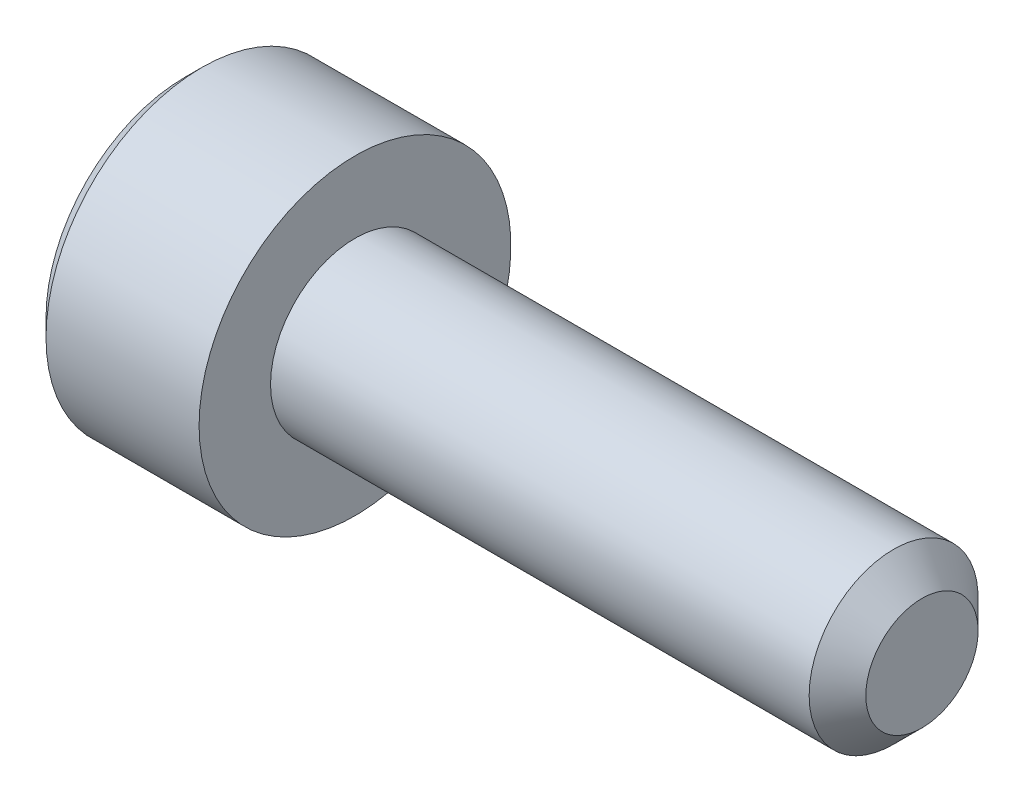
ISO-10303-21;
HEADER;
FILE_DESCRIPTION(('STEP AP214'),'2;1');
FILE_NAME('part.step','',(''),(''),'','','');
FILE_SCHEMA(('AUTOMOTIVE_DESIGN { 1 0 10303 214 1 1 1 1 }'));
ENDSEC;
DATA;
#1=APPLICATION_CONTEXT('core data for automotive mechanical design processes');
#2=APPLICATION_PROTOCOL_DEFINITION('international standard','automotive_design',2000,#1);
#3=PRODUCT_CONTEXT('',#1,'mechanical');
#4=PRODUCT('Part','Part','',(#3));
#5=PRODUCT_RELATED_PRODUCT_CATEGORY('part','',(#4));
#6=PRODUCT_DEFINITION_FORMATION('','',#4);
#7=PRODUCT_DEFINITION_CONTEXT('part definition',#1,'design');
#8=PRODUCT_DEFINITION('design','',#6,#7);
#9=PRODUCT_DEFINITION_SHAPE('','',#8);
#10=(LENGTH_UNIT() NAMED_UNIT(*) SI_UNIT(.MILLI.,.METRE.));
#11=(NAMED_UNIT(*) PLANE_ANGLE_UNIT() SI_UNIT($,.RADIAN.));
#12=(NAMED_UNIT(*) SI_UNIT($,.STERADIAN.) SOLID_ANGLE_UNIT());
#13=UNCERTAINTY_MEASURE_WITH_UNIT(LENGTH_MEASURE(1.E-05),#10,'distance_accuracy_value','');
#14=(GEOMETRIC_REPRESENTATION_CONTEXT(3) GLOBAL_UNCERTAINTY_ASSIGNED_CONTEXT((#13)) GLOBAL_UNIT_ASSIGNED_CONTEXT((#10,
#11,#12)) REPRESENTATION_CONTEXT('',''));
#15=CARTESIAN_POINT('',(0.,0.,0.));
#16=DIRECTION('',(0.,0.,1.));
#17=DIRECTION('',(1.,0.,0.));
#18=AXIS2_PLACEMENT_3D('',#15,#16,#17);
#19=CARTESIAN_POINT('',(0.,0.,0.));
#20=DIRECTION('',(1.,0.,0.));
#21=DIRECTION('',(0.,0.,-1.));
#22=AXIS2_PLACEMENT_3D('',#19,#20,#21);
#23=PLANE('',#22);
#24=DIRECTION('',(0.,0.866025403784439,0.5));
#25=VECTOR('',#24,1.);
#26=CARTESIAN_POINT('',(0.,1.4,-0.981495457622362));
#27=LINE('',#26,#25);
#28=CARTESIAN_POINT('',(0.,0.,-1.78978583448784));
#29=VERTEX_POINT('',#28);
#30=CARTESIAN_POINT('',(0.,1.55,-0.894892917243918));
#31=VERTEX_POINT('',#30);
#32=EDGE_CURVE('E154',#29,#31,#27,.T.);
#33=ORIENTED_EDGE('',*,*,#32,.T.);
#34=DIRECTION('',(0.,0.,1.));
#35=VECTOR('',#34,1.);
#36=CARTESIAN_POINT('',(0.,1.55,0.721687836487032));
#37=LINE('',#36,#35);
#38=CARTESIAN_POINT('',(0.,1.55,0.894892917243919));
#39=VERTEX_POINT('',#38);
#40=EDGE_CURVE('E164',#31,#39,#37,.T.);
#41=ORIENTED_EDGE('',*,*,#40,.T.);
#42=DIRECTION('',(0.,-0.866025403784439,0.5));
#43=VECTOR('',#42,1.);
#44=CARTESIAN_POINT('',(0.,0.15,1.7031832941094));
#45=LINE('',#44,#43);
#46=CARTESIAN_POINT('',(0.,0.,1.78978583448784));
#47=VERTEX_POINT('',#46);
#48=EDGE_CURVE('E162',#39,#47,#45,.T.);
#49=ORIENTED_EDGE('',*,*,#48,.T.);
#50=DIRECTION('',(0.,-0.866025403784439,-0.5));
#51=VECTOR('',#50,1.);
#52=CARTESIAN_POINT('',(0.,-1.4,0.981495457622364));
#53=LINE('',#52,#51);
#54=CARTESIAN_POINT('',(0.,-1.55,0.89489291724392));
#55=VERTEX_POINT('',#54);
#56=EDGE_CURVE('E160',#47,#55,#53,.T.);
#57=ORIENTED_EDGE('',*,*,#56,.T.);
#58=DIRECTION('',(0.,0.,-1.));
#59=VECTOR('',#58,1.);
#60=CARTESIAN_POINT('',(0.,-1.55,-0.721687836487031));
#61=LINE('',#60,#59);
#62=CARTESIAN_POINT('',(0.,-1.55,-0.894892917243919));
#63=VERTEX_POINT('',#62);
#64=EDGE_CURVE('E158',#55,#63,#61,.T.);
#65=ORIENTED_EDGE('',*,*,#64,.T.);
#66=DIRECTION('',(0.,0.866025403784439,-0.5));
#67=VECTOR('',#66,1.);
#68=CARTESIAN_POINT('',(0.,-0.149999999999999,-1.7031832941094));
#69=LINE('',#68,#67);
#70=EDGE_CURVE('E156',#63,#29,#69,.T.);
#71=ORIENTED_EDGE('',*,*,#70,.T.);
#72=EDGE_LOOP('',(#33,#41,#49,#57,#65,#71));
#73=FACE_BOUND('',#72,.T.);
#74=CARTESIAN_POINT('',(0.,0.,0.));
#75=DIRECTION('',(1.,0.,0.));
#76=DIRECTION('',(0.,0.,-1.));
#77=AXIS2_PLACEMENT_3D('',#74,#75,#76);
#78=CIRCLE('',#77,2.45);
#79=CARTESIAN_POINT('',(0.,0.,-2.45));
#80=VERTEX_POINT('',#79);
#81=EDGE_CURVE('E148',#80,#80,#78,.F.);
#82=ORIENTED_EDGE('',*,*,#81,.T.);
#83=EDGE_LOOP('',(#82));
#84=FACE_BOUND('',#83,.T.);
#85=ADVANCED_FACE('F33',(#73,#84),#23,.F.);
#86=CARTESIAN_POINT('',(13.,0.,0.));
#87=DIRECTION('',(-1.,0.,0.));
#88=DIRECTION('',(0.,0.,1.));
#89=AXIS2_PLACEMENT_3D('',#86,#87,#88);
#90=PLANE('',#89);
#91=CARTESIAN_POINT('',(13.,0.,0.));
#92=DIRECTION('',(-1.,0.,0.));
#93=DIRECTION('',(0.,0.,1.));
#94=AXIS2_PLACEMENT_3D('',#91,#92,#93);
#95=CIRCLE('',#94,0.989999999999991);
#96=CARTESIAN_POINT('',(13.,0.,0.989999999999991));
#97=VERTEX_POINT('',#96);
#98=EDGE_CURVE('E145',#97,#97,#95,.F.);
#99=ORIENTED_EDGE('',*,*,#98,.T.);
#100=EDGE_LOOP('',(#99));
#101=FACE_BOUND('',#100,.T.);
#102=ADVANCED_FACE('F244',(#101),#90,.F.);
#103=CARTESIAN_POINT('',(-88.7054908485857,0.,0.));
#104=DIRECTION('',(-1.,0.,0.));
#105=DIRECTION('',(0.,0.,1.));
#106=AXIS2_PLACEMENT_3D('',#103,#104,#105);
#107=CYLINDRICAL_SURFACE('',#106,1.49);
#108=CARTESIAN_POINT('',(12.5,0.,0.));
#109=DIRECTION('',(-1.,0.,0.));
#110=DIRECTION('',(0.,0.,1.));
#111=AXIS2_PLACEMENT_3D('',#108,#109,#110);
#112=CIRCLE('',#111,1.49);
#113=CARTESIAN_POINT('',(12.5,0.,1.49));
#114=VERTEX_POINT('',#113);
#115=EDGE_CURVE('E142',#114,#114,#112,.T.);
#116=ORIENTED_EDGE('',*,*,#115,.T.);
#117=EDGE_LOOP('',(#116));
#118=FACE_BOUND('',#117,.T.);
#119=CARTESIAN_POINT('',(3.,0.,0.));
#120=DIRECTION('',(-1.,0.,0.));
#121=DIRECTION('',(0.,0.,1.));
#122=AXIS2_PLACEMENT_3D('',#119,#120,#121);
#123=CIRCLE('',#122,1.49);
#124=CARTESIAN_POINT('',(3.,0.,1.49));
#125=VERTEX_POINT('',#124);
#126=EDGE_CURVE('E134',#125,#125,#123,.T.);
#127=ORIENTED_EDGE('',*,*,#126,.F.);
#128=EDGE_LOOP('',(#127));
#129=FACE_BOUND('',#128,.T.);
#130=ADVANCED_FACE('F249',(#118,#129),#107,.T.);
#131=CARTESIAN_POINT('',(3.,1.49,0.));
#132=DIRECTION('',(-1.,0.,0.));
#133=DIRECTION('',(0.,0.,1.));
#134=AXIS2_PLACEMENT_3D('',#131,#132,#133);
#135=PLANE('',#134);
#136=CARTESIAN_POINT('',(3.,0.,0.));
#137=DIRECTION('',(-1.,0.,0.));
#138=DIRECTION('',(0.,0.,1.));
#139=AXIS2_PLACEMENT_3D('',#136,#137,#138);
#140=CIRCLE('',#139,2.75);
#141=CARTESIAN_POINT('',(3.,0.,2.75));
#142=VERTEX_POINT('',#141);
#143=EDGE_CURVE('E130',#142,#142,#140,.T.);
#144=ORIENTED_EDGE('',*,*,#143,.F.);
#145=EDGE_LOOP('',(#144));
#146=FACE_BOUND('',#145,.T.);
#147=ORIENTED_EDGE('',*,*,#126,.T.);
#148=EDGE_LOOP('',(#147));
#149=FACE_BOUND('',#148,.T.);
#150=ADVANCED_FACE('F259',(#146,#149),#135,.F.);
#151=CARTESIAN_POINT('',(-88.7054908485857,0.,0.));
#152=DIRECTION('',(-1.,0.,0.));
#153=DIRECTION('',(0.,0.,1.));
#154=AXIS2_PLACEMENT_3D('',#151,#152,#153);
#155=CYLINDRICAL_SURFACE('',#154,2.75);
#156=CARTESIAN_POINT('',(0.299999999999995,0.,0.));
#157=DIRECTION('',(1.,0.,0.));
#158=DIRECTION('',(0.,0.,-1.));
#159=AXIS2_PLACEMENT_3D('',#156,#157,#158);
#160=CIRCLE('',#159,2.75);
#161=CARTESIAN_POINT('',(0.299999999999995,0.,-2.75));
#162=VERTEX_POINT('',#161);
#163=EDGE_CURVE('E151',#162,#162,#160,.T.);
#164=ORIENTED_EDGE('',*,*,#163,.T.);
#165=EDGE_LOOP('',(#164));
#166=FACE_BOUND('',#165,.T.);
#167=ORIENTED_EDGE('',*,*,#143,.T.);
#168=EDGE_LOOP('',(#167));
#169=FACE_BOUND('',#168,.T.);
#170=ADVANCED_FACE('F255',(#166,#169),#155,.T.);
#171=CARTESIAN_POINT('',(12.5,0.,0.));
#172=DIRECTION('',(-1.,0.,0.));
#173=DIRECTION('',(0.,0.,1.));
#174=AXIS2_PLACEMENT_3D('',#171,#172,#173);
#175=CONICAL_SURFACE('',#174,1.49,0.785398163397452);
#176=ORIENTED_EDGE('',*,*,#98,.F.);
#177=EDGE_LOOP('',(#176));
#178=FACE_BOUND('',#177,.T.);
#179=ORIENTED_EDGE('',*,*,#115,.F.);
#180=EDGE_LOOP('',(#179));
#181=FACE_BOUND('',#180,.T.);
#182=ADVANCED_FACE('F258',(#178,#181),#175,.T.);
#183=CARTESIAN_POINT('',(0.,0.,0.));
#184=DIRECTION('',(1.,0.,0.));
#185=DIRECTION('',(0.,0.,-1.));
#186=AXIS2_PLACEMENT_3D('',#183,#184,#185);
#187=CONICAL_SURFACE('',#186,2.45,0.785398163397455);
#188=ORIENTED_EDGE('',*,*,#163,.F.);
#189=EDGE_LOOP('',(#188));
#190=FACE_BOUND('',#189,.T.);
#191=ORIENTED_EDGE('',*,*,#81,.F.);
#192=EDGE_LOOP('',(#191));
#193=FACE_BOUND('',#192,.T.);
#194=ADVANCED_FACE('F269',(#190,#193),#187,.T.);
#195=CARTESIAN_POINT('',(2.5,1.25,0.721687836487032));
#196=DIRECTION('',(0.,-0.5,-0.866025403784438));
#197=DIRECTION('',(0.,0.866025403784439,-0.5));
#198=AXIS2_PLACEMENT_3D('',#195,#196,#197);
#199=PLANE('',#198);
#200=DIRECTION('',(-1.,0.,0.));
#201=VECTOR('',#200,1.);
#202=CARTESIAN_POINT('',(2.5,0.,1.44337567297407));
#203=LINE('',#202,#201);
#204=CARTESIAN_POINT('',(2.5,0.,1.44337567297407));
#205=VERTEX_POINT('',#204);
#206=CARTESIAN_POINT('',(0.300000000000002,0.,1.44337567297407));
#207=VERTEX_POINT('',#206);
#208=EDGE_CURVE('E122',#205,#207,#203,.T.);
#209=ORIENTED_EDGE('',*,*,#208,.T.);
#210=DIRECTION('',(0.,0.866025403784439,-0.5));
#211=VECTOR('',#210,1.);
#212=CARTESIAN_POINT('',(0.300000000000002,1.25,0.721687836487032));
#213=LINE('',#212,#211);
#214=CARTESIAN_POINT('',(0.300000000000002,1.25,0.721687836487032));
#215=VERTEX_POINT('',#214);
#216=EDGE_CURVE('E170',#207,#215,#213,.T.);
#217=ORIENTED_EDGE('',*,*,#216,.T.);
#218=DIRECTION('',(-1.,0.,0.));
#219=VECTOR('',#218,1.);
#220=CARTESIAN_POINT('',(2.5,1.25,0.721687836487032));
#221=LINE('',#220,#219);
#222=CARTESIAN_POINT('',(2.5,1.25,0.721687836487032));
#223=VERTEX_POINT('',#222);
#224=EDGE_CURVE('E125',#223,#215,#221,.T.);
#225=ORIENTED_EDGE('',*,*,#224,.F.);
#226=DIRECTION('',(0.,-0.866025403784439,0.5));
#227=VECTOR('',#226,1.);
#228=CARTESIAN_POINT('',(2.5,1.25,0.721687836487032));
#229=LINE('',#228,#227);
#230=EDGE_CURVE('E110',#223,#205,#229,.T.);
#231=ORIENTED_EDGE('',*,*,#230,.T.);
#232=EDGE_LOOP('',(#209,#217,#225,#231));
#233=FACE_BOUND('',#232,.T.);
#234=ADVANCED_FACE('F121',(#233),#199,.T.);
#235=CARTESIAN_POINT('',(2.5,0.,1.44337567297407));
#236=DIRECTION('',(0.,0.5,-0.866025403784438));
#237=DIRECTION('',(0.,0.866025403784439,0.5));
#238=AXIS2_PLACEMENT_3D('',#235,#236,#237);
#239=PLANE('',#238);
#240=DIRECTION('',(-1.,0.,0.));
#241=VECTOR('',#240,1.);
#242=CARTESIAN_POINT('',(2.5,-1.25,0.721687836487033));
#243=LINE('',#242,#241);
#244=CARTESIAN_POINT('',(2.5,-1.25,0.721687836487033));
#245=VERTEX_POINT('',#244);
#246=CARTESIAN_POINT('',(0.300000000000002,-1.25,0.721687836487033));
#247=VERTEX_POINT('',#246);
#248=EDGE_CURVE('E131',#245,#247,#243,.T.);
#249=ORIENTED_EDGE('',*,*,#248,.T.);
#250=DIRECTION('',(0.,0.866025403784439,0.5));
#251=VECTOR('',#250,1.);
#252=CARTESIAN_POINT('',(0.300000000000002,0.,1.44337567297407));
#253=LINE('',#252,#251);
#254=EDGE_CURVE('E129',#247,#207,#253,.T.);
#255=ORIENTED_EDGE('',*,*,#254,.T.);
#256=ORIENTED_EDGE('',*,*,#208,.F.);
#257=DIRECTION('',(0.,-0.866025403784439,-0.5));
#258=VECTOR('',#257,1.);
#259=CARTESIAN_POINT('',(2.5,0.,1.44337567297407));
#260=LINE('',#259,#258);
#261=EDGE_CURVE('E106',#205,#245,#260,.T.);
#262=ORIENTED_EDGE('',*,*,#261,.T.);
#263=EDGE_LOOP('',(#249,#255,#256,#262));
#264=FACE_BOUND('',#263,.T.);
#265=ADVANCED_FACE('F127',(#264),#239,.T.);
#266=CARTESIAN_POINT('',(2.5,-1.25,0.721687836487033));
#267=DIRECTION('',(0.,1.,0.));
#268=DIRECTION('',(0.,0.,1.));
#269=AXIS2_PLACEMENT_3D('',#266,#267,#268);
#270=PLANE('',#269);
#271=DIRECTION('',(-1.,0.,0.));
#272=VECTOR('',#271,1.);
#273=CARTESIAN_POINT('',(2.5,-1.25,-0.721687836487031));
#274=LINE('',#273,#272);
#275=CARTESIAN_POINT('',(2.5,-1.25,-0.721687836487031));
#276=VERTEX_POINT('',#275);
#277=CARTESIAN_POINT('',(0.300000000000002,-1.25,-0.721687836487031));
#278=VERTEX_POINT('',#277);
#279=EDGE_CURVE('E136',#276,#278,#274,.T.);
#280=ORIENTED_EDGE('',*,*,#279,.T.);
#281=DIRECTION('',(0.,0.,1.));
#282=VECTOR('',#281,1.);
#283=CARTESIAN_POINT('',(0.300000000000002,-1.25,0.721687836487033));
#284=LINE('',#283,#282);
#285=EDGE_CURVE('E173',#278,#247,#284,.T.);
#286=ORIENTED_EDGE('',*,*,#285,.T.);
#287=ORIENTED_EDGE('',*,*,#248,.F.);
#288=DIRECTION('',(0.,0.,-1.));
#289=VECTOR('',#288,1.);
#290=CARTESIAN_POINT('',(2.5,-1.25,0.721687836487033));
#291=LINE('',#290,#289);
#292=EDGE_CURVE('E112',#245,#276,#291,.T.);
#293=ORIENTED_EDGE('',*,*,#292,.T.);
#294=EDGE_LOOP('',(#280,#286,#287,#293));
#295=FACE_BOUND('',#294,.T.);
#296=ADVANCED_FACE('F200',(#295),#270,.T.);
#297=CARTESIAN_POINT('',(2.5,-1.25,-0.721687836487031));
#298=DIRECTION('',(0.,0.5,0.866025403784439));
#299=DIRECTION('',(0.,-0.866025403784439,0.5));
#300=AXIS2_PLACEMENT_3D('',#297,#298,#299);
#301=PLANE('',#300);
#302=DIRECTION('',(-1.,0.,0.));
#303=VECTOR('',#302,1.);
#304=CARTESIAN_POINT('',(2.5,0.,-1.44337567297406));
#305=LINE('',#304,#303);
#306=CARTESIAN_POINT('',(2.5,0.,-1.44337567297406));
#307=VERTEX_POINT('',#306);
#308=CARTESIAN_POINT('',(0.300000000000002,0.,-1.44337567297406));
#309=VERTEX_POINT('',#308);
#310=EDGE_CURVE('E201',#307,#309,#305,.T.);
#311=ORIENTED_EDGE('',*,*,#310,.T.);
#312=DIRECTION('',(0.,-0.866025403784439,0.5));
#313=VECTOR('',#312,1.);
#314=CARTESIAN_POINT('',(0.300000000000002,-1.25,-0.721687836487031));
#315=LINE('',#314,#313);
#316=EDGE_CURVE('E42',#309,#278,#315,.T.);
#317=ORIENTED_EDGE('',*,*,#316,.T.);
#318=ORIENTED_EDGE('',*,*,#279,.F.);
#319=DIRECTION('',(0.,0.866025403784439,-0.499999999999999));
#320=VECTOR('',#319,1.);
#321=CARTESIAN_POINT('',(2.5,-1.25,-0.721687836487031));
#322=LINE('',#321,#320);
#323=EDGE_CURVE('E211',#276,#307,#322,.T.);
#324=ORIENTED_EDGE('',*,*,#323,.T.);
#325=EDGE_LOOP('',(#311,#317,#318,#324));
#326=FACE_BOUND('',#325,.T.);
#327=ADVANCED_FACE('F213',(#326),#301,.T.);
#328=CARTESIAN_POINT('',(2.5,0.,-1.44337567297406));
#329=DIRECTION('',(0.,-0.5,0.866025403784439));
#330=DIRECTION('',(0.,-0.866025403784439,-0.5));
#331=AXIS2_PLACEMENT_3D('',#328,#329,#330);
#332=PLANE('',#331);
#333=DIRECTION('',(-1.,0.,0.));
#334=VECTOR('',#333,1.);
#335=CARTESIAN_POINT('',(2.5,1.25,-0.72168783648703));
#336=LINE('',#335,#334);
#337=CARTESIAN_POINT('',(2.5,1.25,-0.72168783648703));
#338=VERTEX_POINT('',#337);
#339=CARTESIAN_POINT('',(0.300000000000002,1.25,-0.72168783648703));
#340=VERTEX_POINT('',#339);
#341=EDGE_CURVE('E202',#338,#340,#336,.T.);
#342=ORIENTED_EDGE('',*,*,#341,.T.);
#343=DIRECTION('',(0.,-0.866025403784439,-0.5));
#344=VECTOR('',#343,1.);
#345=CARTESIAN_POINT('',(0.300000000000002,0.,-1.44337567297406));
#346=LINE('',#345,#344);
#347=EDGE_CURVE('E11',#340,#309,#346,.T.);
#348=ORIENTED_EDGE('',*,*,#347,.T.);
#349=ORIENTED_EDGE('',*,*,#310,.F.);
#350=DIRECTION('',(0.,0.866025403784438,0.5));
#351=VECTOR('',#350,1.);
#352=CARTESIAN_POINT('',(2.5,0.,-1.44337567297406));
#353=LINE('',#352,#351);
#354=EDGE_CURVE('E209',#307,#338,#353,.T.);
#355=ORIENTED_EDGE('',*,*,#354,.T.);
#356=EDGE_LOOP('',(#342,#348,#349,#355));
#357=FACE_BOUND('',#356,.T.);
#358=ADVANCED_FACE('F215',(#357),#332,.T.);
#359=CARTESIAN_POINT('',(2.5,1.25,-0.72168783648703));
#360=DIRECTION('',(0.,-1.,0.));
#361=DIRECTION('',(0.,0.,-1.));
#362=AXIS2_PLACEMENT_3D('',#359,#360,#361);
#363=PLANE('',#362);
#364=ORIENTED_EDGE('',*,*,#224,.T.);
#365=DIRECTION('',(0.,0.,-1.));
#366=VECTOR('',#365,1.);
#367=CARTESIAN_POINT('',(0.300000000000002,1.25,-0.72168783648703));
#368=LINE('',#367,#366);
#369=EDGE_CURVE('E167',#215,#340,#368,.T.);
#370=ORIENTED_EDGE('',*,*,#369,.T.);
#371=ORIENTED_EDGE('',*,*,#341,.F.);
#372=DIRECTION('',(0.,0.,1.));
#373=VECTOR('',#372,1.);
#374=CARTESIAN_POINT('',(2.5,1.25,-0.72168783648703));
#375=LINE('',#374,#373);
#376=EDGE_CURVE('E207',#338,#223,#375,.T.);
#377=ORIENTED_EDGE('',*,*,#376,.T.);
#378=EDGE_LOOP('',(#364,#370,#371,#377));
#379=FACE_BOUND('',#378,.T.);
#380=ADVANCED_FACE('F218',(#379),#363,.T.);
#381=CARTESIAN_POINT('',(2.5,0.,0.));
#382=DIRECTION('',(1.,0.,0.));
#383=DIRECTION('',(0.,0.,-1.));
#384=AXIS2_PLACEMENT_3D('',#381,#382,#383);
#385=PLANE('',#384);
#386=ORIENTED_EDGE('',*,*,#230,.F.);
#387=ORIENTED_EDGE('',*,*,#376,.F.);
#388=ORIENTED_EDGE('',*,*,#354,.F.);
#389=ORIENTED_EDGE('',*,*,#323,.F.);
#390=ORIENTED_EDGE('',*,*,#292,.F.);
#391=ORIENTED_EDGE('',*,*,#261,.F.);
#392=EDGE_LOOP('',(#386,#387,#388,#389,#390,#391));
#393=FACE_BOUND('',#392,.T.);
#394=ADVANCED_FACE('F108',(#393),#385,.F.);
#395=CARTESIAN_POINT('',(0.,-1.55,0.));
#396=DIRECTION('',(-0.707106781186546,0.70710678118655,0.));
#397=DIRECTION('',(0.,0.,1.));
#398=AXIS2_PLACEMENT_3D('',#395,#396,#397);
#399=PLANE('',#398);
#400=DIRECTION('',(0.654653670707979,0.654653670707976,-0.377964473009226));
#401=VECTOR('',#400,1.);
#402=CARTESIAN_POINT('',(0.221428571428572,-1.32857142857143,0.767051071923361));
#403=LINE('',#402,#401);
#404=EDGE_CURVE('E185',#247,#55,#403,.F.);
#405=ORIENTED_EDGE('',*,*,#404,.F.);
#406=ORIENTED_EDGE('',*,*,#285,.F.);
#407=DIRECTION('',(0.654653670707979,0.654653670707975,0.377964473009226));
#408=VECTOR('',#407,1.);
#409=CARTESIAN_POINT('',(0.221428571428572,-1.32857142857143,-0.76705107192336));
#410=LINE('',#409,#408);
#411=EDGE_CURVE('E37',#63,#278,#410,.T.);
#412=ORIENTED_EDGE('',*,*,#411,.F.);
#413=ORIENTED_EDGE('',*,*,#64,.F.);
#414=EDGE_LOOP('',(#405,#406,#412,#413));
#415=FACE_BOUND('',#414,.T.);
#416=ADVANCED_FACE('F35',(#415),#399,.T.);
#417=CARTESIAN_POINT('',(0.,-0.774999999999999,-1.34233937586588));
#418=DIRECTION('',(-0.707106781186546,0.353553390593274,0.612372435695797));
#419=DIRECTION('',(0.,-0.866025403784439,0.5));
#420=AXIS2_PLACEMENT_3D('',#417,#418,#419);
#421=PLANE('',#420);
#422=ORIENTED_EDGE('',*,*,#411,.T.);
#423=ORIENTED_EDGE('',*,*,#316,.F.);
#424=DIRECTION('',(0.654653670707979,0.,0.755928946018452));
#425=VECTOR('',#424,1.);
#426=CARTESIAN_POINT('',(0.221428571428571,0.,-1.53410214384672));
#427=LINE('',#426,#425);
#428=EDGE_CURVE('E183',#29,#309,#427,.T.);
#429=ORIENTED_EDGE('',*,*,#428,.F.);
#430=ORIENTED_EDGE('',*,*,#70,.F.);
#431=EDGE_LOOP('',(#422,#423,#429,#430));
#432=FACE_BOUND('',#431,.T.);
#433=ADVANCED_FACE('F194',(#432),#421,.T.);
#434=CARTESIAN_POINT('',(0.,-0.775000000000001,1.34233937586588));
#435=DIRECTION('',(-0.707106781186545,0.353553390593275,-0.612372435695796));
#436=DIRECTION('',(0.,0.866025403784439,0.5));
#437=AXIS2_PLACEMENT_3D('',#434,#435,#436);
#438=PLANE('',#437);
#439=ORIENTED_EDGE('',*,*,#404,.T.);
#440=ORIENTED_EDGE('',*,*,#56,.F.);
#441=DIRECTION('',(0.654653670707979,0.,-0.755928946018452));
#442=VECTOR('',#441,1.);
#443=CARTESIAN_POINT('',(0.221428571428572,0.,1.53410214384672));
#444=LINE('',#443,#442);
#445=EDGE_CURVE('E180',#207,#47,#444,.F.);
#446=ORIENTED_EDGE('',*,*,#445,.F.);
#447=ORIENTED_EDGE('',*,*,#254,.F.);
#448=EDGE_LOOP('',(#439,#440,#446,#447));
#449=FACE_BOUND('',#448,.T.);
#450=ADVANCED_FACE('F235',(#449),#438,.T.);
#451=CARTESIAN_POINT('',(0.,0.775,-1.34233937586588));
#452=DIRECTION('',(-0.707106781186545,-0.353553390593275,0.612372435695796));
#453=DIRECTION('',(0.,-0.866025403784439,-0.5));
#454=AXIS2_PLACEMENT_3D('',#451,#452,#453);
#455=PLANE('',#454);
#456=ORIENTED_EDGE('',*,*,#428,.T.);
#457=ORIENTED_EDGE('',*,*,#347,.F.);
#458=DIRECTION('',(-0.654653670707979,0.654653670707976,-0.377964473009226));
#459=VECTOR('',#458,1.);
#460=CARTESIAN_POINT('',(0.221428571428571,1.32857142857143,-0.767051071923359));
#461=LINE('',#460,#459);
#462=EDGE_CURVE('E178',#31,#340,#461,.F.);
#463=ORIENTED_EDGE('',*,*,#462,.F.);
#464=ORIENTED_EDGE('',*,*,#32,.F.);
#465=EDGE_LOOP('',(#456,#457,#463,#464));
#466=FACE_BOUND('',#465,.T.);
#467=ADVANCED_FACE('F233',(#466),#455,.T.);
#468=CARTESIAN_POINT('',(0.,0.775,1.34233937586588));
#469=DIRECTION('',(-0.707106781186545,-0.353553390593275,-0.612372435695796));
#470=DIRECTION('',(0.,0.866025403784439,-0.5));
#471=AXIS2_PLACEMENT_3D('',#468,#469,#470);
#472=PLANE('',#471);
#473=ORIENTED_EDGE('',*,*,#445,.T.);
#474=ORIENTED_EDGE('',*,*,#48,.F.);
#475=DIRECTION('',(0.654653670707979,-0.654653670707976,-0.377964473009226));
#476=VECTOR('',#475,1.);
#477=CARTESIAN_POINT('',(0.221428571428571,1.32857142857143,0.76705107192336));
#478=LINE('',#477,#476);
#479=EDGE_CURVE('E176',#215,#39,#478,.F.);
#480=ORIENTED_EDGE('',*,*,#479,.F.);
#481=ORIENTED_EDGE('',*,*,#216,.F.);
#482=EDGE_LOOP('',(#473,#474,#480,#481));
#483=FACE_BOUND('',#482,.T.);
#484=ADVANCED_FACE('F228',(#483),#472,.T.);
#485=CARTESIAN_POINT('',(0.,1.55,0.));
#486=DIRECTION('',(-0.707106781186546,-0.70710678118655,0.));
#487=DIRECTION('',(0.,0.,-1.));
#488=AXIS2_PLACEMENT_3D('',#485,#486,#487);
#489=PLANE('',#488);
#490=ORIENTED_EDGE('',*,*,#462,.T.);
#491=ORIENTED_EDGE('',*,*,#369,.F.);
#492=ORIENTED_EDGE('',*,*,#479,.T.);
#493=ORIENTED_EDGE('',*,*,#40,.F.);
#494=EDGE_LOOP('',(#490,#491,#492,#493));
#495=FACE_BOUND('',#494,.T.);
#496=ADVANCED_FACE('F222',(#495),#489,.T.);
#497=CLOSED_SHELL('',(#85,#102,#130,#150,#170,#182,#194,#234,#265,#296,#327,#358,#380,#394,#416,
#433,#450,#467,#484,#496));
#498=MANIFOLD_SOLID_BREP('B2',#497);
#499=ADVANCED_BREP_SHAPE_REPRESENTATION('',(#18,#498),#14);
#500=SHAPE_DEFINITION_REPRESENTATION(#9,#499);
ENDSEC;
END-ISO-10303-21;
